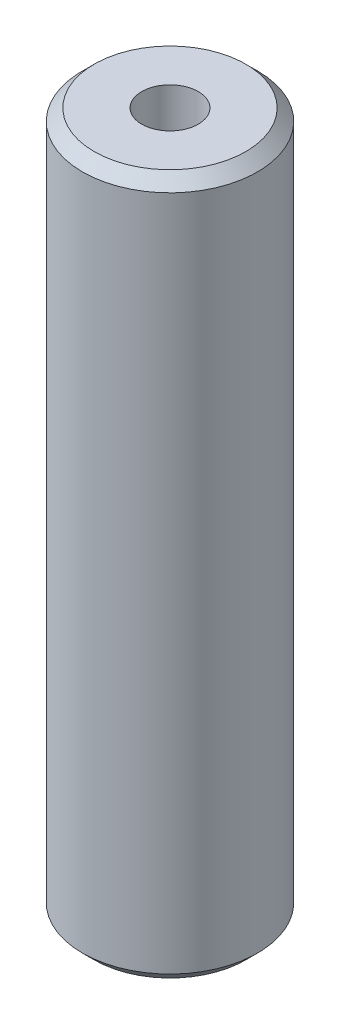
ISO-10303-21;
HEADER;
FILE_DESCRIPTION(('STEP AP214'),'2;1');
FILE_NAME('part.step','',(''),(''),'','','');
FILE_SCHEMA(('AUTOMOTIVE_DESIGN { 1 0 10303 214 1 1 1 1 }'));
ENDSEC;
DATA;
#1=APPLICATION_CONTEXT('core data for automotive mechanical design processes');
#2=APPLICATION_PROTOCOL_DEFINITION('international standard','automotive_design',2000,#1);
#3=PRODUCT_CONTEXT('',#1,'mechanical');
#4=PRODUCT('Part','Part','',(#3));
#5=PRODUCT_RELATED_PRODUCT_CATEGORY('part','',(#4));
#6=PRODUCT_DEFINITION_FORMATION('','',#4);
#7=PRODUCT_DEFINITION_CONTEXT('part definition',#1,'design');
#8=PRODUCT_DEFINITION('design','',#6,#7);
#9=PRODUCT_DEFINITION_SHAPE('','',#8);
#10=(LENGTH_UNIT() NAMED_UNIT(*) SI_UNIT(.MILLI.,.METRE.));
#11=(NAMED_UNIT(*) PLANE_ANGLE_UNIT() SI_UNIT($,.RADIAN.));
#12=(NAMED_UNIT(*) SI_UNIT($,.STERADIAN.) SOLID_ANGLE_UNIT());
#13=UNCERTAINTY_MEASURE_WITH_UNIT(LENGTH_MEASURE(1.E-05),#10,'distance_accuracy_value','');
#14=(GEOMETRIC_REPRESENTATION_CONTEXT(3) GLOBAL_UNCERTAINTY_ASSIGNED_CONTEXT((#13)) GLOBAL_UNIT_ASSIGNED_CONTEXT((#10,
#11,#12)) REPRESENTATION_CONTEXT('',''));
#15=CARTESIAN_POINT('',(0.,0.,0.));
#16=DIRECTION('',(0.,0.,1.));
#17=DIRECTION('',(1.,0.,0.));
#18=AXIS2_PLACEMENT_3D('',#15,#16,#17);
#19=CARTESIAN_POINT('',(0.,199.97304609817,0.));
#20=DIRECTION('',(0.,-1.,0.));
#21=DIRECTION('',(0.,0.,-1.));
#22=AXIS2_PLACEMENT_3D('',#19,#20,#21);
#23=CYLINDRICAL_SURFACE('',#22,25.);
#24=CARTESIAN_POINT('',(0.,196.624779671579,0.));
#25=DIRECTION('',(0.,1.,0.));
#26=DIRECTION('',(0.,0.,1.));
#27=AXIS2_PLACEMENT_3D('',#24,#25,#26);
#28=CIRCLE('',#27,25.);
#29=CARTESIAN_POINT('',(0.,196.624779671579,25.));
#30=VERTEX_POINT('',#29);
#31=EDGE_CURVE('E50',#30,#30,#28,.F.);
#32=ORIENTED_EDGE('',*,*,#31,.T.);
#33=EDGE_LOOP('',(#32));
#34=FACE_BOUND('',#33,.T.);
#35=CARTESIAN_POINT('',(0.,3.34826642659145,0.));
#36=DIRECTION('',(0.,1.,0.));
#37=DIRECTION('',(0.,0.,1.));
#38=AXIS2_PLACEMENT_3D('',#35,#36,#37);
#39=CIRCLE('',#38,25.);
#40=CARTESIAN_POINT('',(0.,3.34826642659145,25.));
#41=VERTEX_POINT('',#40);
#42=EDGE_CURVE('E51',#41,#41,#39,.T.);
#43=ORIENTED_EDGE('',*,*,#42,.T.);
#44=EDGE_LOOP('',(#43));
#45=FACE_BOUND('',#44,.T.);
#46=ADVANCED_FACE('F39',(#34,#45),#23,.T.);
#47=CARTESIAN_POINT('',(0.,199.97304609817,0.));
#48=DIRECTION('',(0.,1.,0.));
#49=DIRECTION('',(0.,0.,1.));
#50=AXIS2_PLACEMENT_3D('',#47,#48,#49);
#51=PLANE('',#50);
#52=CARTESIAN_POINT('',(0.,199.97304609817,0.));
#53=DIRECTION('',(0.,1.,0.));
#54=DIRECTION('',(0.,0.,1.));
#55=AXIS2_PLACEMENT_3D('',#52,#53,#54);
#56=CIRCLE('',#55,21.6517335734085);
#57=CARTESIAN_POINT('',(0.,199.97304609817,21.6517335734085));
#58=VERTEX_POINT('',#57);
#59=EDGE_CURVE('E54',#58,#58,#56,.T.);
#60=ORIENTED_EDGE('',*,*,#59,.T.);
#61=EDGE_LOOP('',(#60));
#62=FACE_BOUND('',#61,.T.);
#63=CARTESIAN_POINT('',(0.,199.97304609817,0.));
#64=DIRECTION('',(0.,1.,0.));
#65=DIRECTION('',(0.,0.,1.));
#66=AXIS2_PLACEMENT_3D('',#63,#64,#65);
#67=CIRCLE('',#66,8.08040876972321);
#68=CARTESIAN_POINT('',(0.,199.97304609817,8.08040876972321));
#69=VERTEX_POINT('',#68);
#70=EDGE_CURVE('E58',#69,#69,#67,.T.);
#71=ORIENTED_EDGE('',*,*,#70,.F.);
#72=EDGE_LOOP('',(#71));
#73=FACE_BOUND('',#72,.T.);
#74=ADVANCED_FACE('F69',(#62,#73),#51,.T.);
#75=CARTESIAN_POINT('',(0.,0.,0.));
#76=DIRECTION('',(0.,1.,0.));
#77=DIRECTION('',(0.,0.,1.));
#78=AXIS2_PLACEMENT_3D('',#75,#76,#77);
#79=PLANE('',#78);
#80=CARTESIAN_POINT('',(0.,0.,0.));
#81=DIRECTION('',(0.,1.,0.));
#82=DIRECTION('',(0.,0.,1.));
#83=AXIS2_PLACEMENT_3D('',#80,#81,#82);
#84=CIRCLE('',#83,21.6517335734085);
#85=CARTESIAN_POINT('',(0.,0.,21.6517335734085));
#86=VERTEX_POINT('',#85);
#87=EDGE_CURVE('E10',#86,#86,#84,.F.);
#88=ORIENTED_EDGE('',*,*,#87,.T.);
#89=EDGE_LOOP('',(#88));
#90=FACE_BOUND('',#89,.T.);
#91=CARTESIAN_POINT('',(0.,0.,0.));
#92=DIRECTION('',(0.,1.,0.));
#93=DIRECTION('',(0.,0.,1.));
#94=AXIS2_PLACEMENT_3D('',#91,#92,#93);
#95=CIRCLE('',#94,8.08040876972321);
#96=CARTESIAN_POINT('',(0.,0.,8.08040876972321));
#97=VERTEX_POINT('',#96);
#98=EDGE_CURVE('E63',#97,#97,#95,.T.);
#99=ORIENTED_EDGE('',*,*,#98,.T.);
#100=EDGE_LOOP('',(#99));
#101=FACE_BOUND('',#100,.T.);
#102=ADVANCED_FACE('F75',(#90,#101),#79,.F.);
#103=CARTESIAN_POINT('',(0.,199.97304609817,0.));
#104=DIRECTION('',(0.,-1.,0.));
#105=DIRECTION('',(0.,0.,-1.));
#106=AXIS2_PLACEMENT_3D('',#103,#104,#105);
#107=CYLINDRICAL_SURFACE('',#106,8.08040876972321);
#108=ORIENTED_EDGE('',*,*,#70,.T.);
#109=EDGE_LOOP('',(#108));
#110=FACE_BOUND('',#109,.T.);
#111=ORIENTED_EDGE('',*,*,#98,.F.);
#112=EDGE_LOOP('',(#111));
#113=FACE_BOUND('',#112,.T.);
#114=ADVANCED_FACE('F70',(#110,#113),#107,.F.);
#115=CARTESIAN_POINT('',(0.,199.97304609817,0.));
#116=DIRECTION('',(0.,-1.,0.));
#117=DIRECTION('',(0.,0.,-1.));
#118=AXIS2_PLACEMENT_3D('',#115,#116,#117);
#119=CONICAL_SURFACE('',#118,21.6517335734085,0.785398163397441);
#120=ORIENTED_EDGE('',*,*,#31,.F.);
#121=EDGE_LOOP('',(#120));
#122=FACE_BOUND('',#121,.T.);
#123=ORIENTED_EDGE('',*,*,#59,.F.);
#124=EDGE_LOOP('',(#123));
#125=FACE_BOUND('',#124,.T.);
#126=ADVANCED_FACE('F81',(#122,#125),#119,.T.);
#127=CARTESIAN_POINT('',(0.,3.34826642659145,0.));
#128=DIRECTION('',(0.,1.,0.));
#129=DIRECTION('',(0.,0.,1.));
#130=AXIS2_PLACEMENT_3D('',#127,#128,#129);
#131=CONICAL_SURFACE('',#130,25.,0.785398163397453);
#132=ORIENTED_EDGE('',*,*,#87,.F.);
#133=EDGE_LOOP('',(#132));
#134=FACE_BOUND('',#133,.T.);
#135=ORIENTED_EDGE('',*,*,#42,.F.);
#136=EDGE_LOOP('',(#135));
#137=FACE_BOUND('',#136,.T.);
#138=ADVANCED_FACE('F45',(#134,#137),#131,.T.);
#139=CLOSED_SHELL('',(#46,#74,#102,#114,#126,#138));
#140=MANIFOLD_SOLID_BREP('B2',#139);
#141=ADVANCED_BREP_SHAPE_REPRESENTATION('',(#18,#140),#14);
#142=SHAPE_DEFINITION_REPRESENTATION(#9,#141);
ENDSEC;
END-ISO-10303-21;
